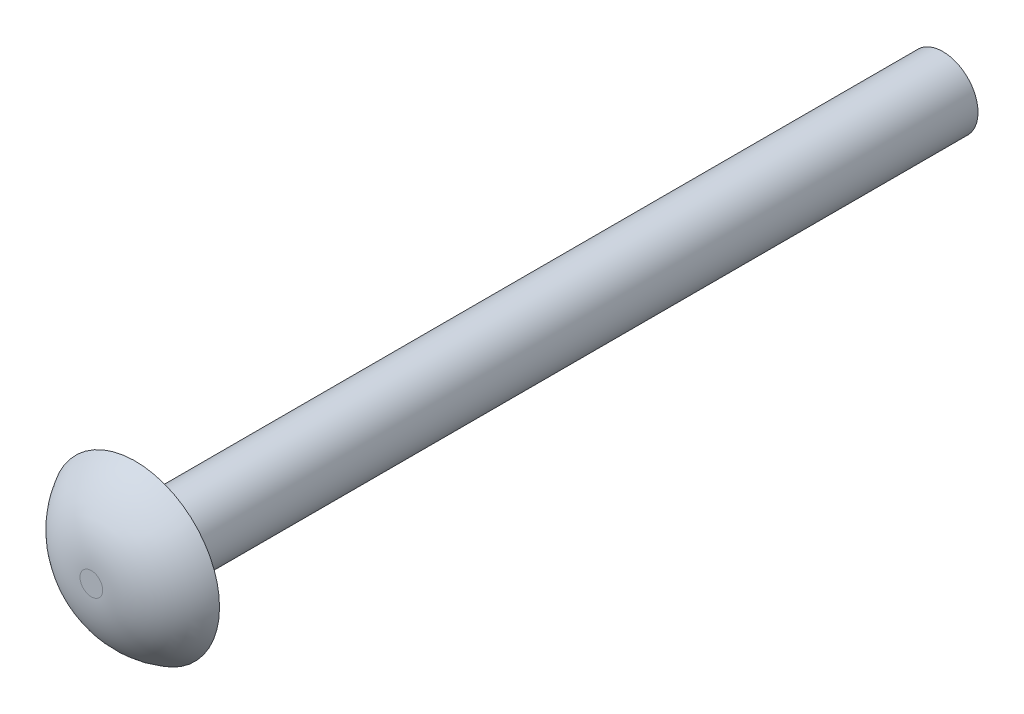
ISO-10303-21;
HEADER;
FILE_DESCRIPTION(('STEP AP214'),'2;1');
FILE_NAME('part.step','',(''),(''),'','','');
FILE_SCHEMA(('AUTOMOTIVE_DESIGN { 1 0 10303 214 1 1 1 1 }'));
ENDSEC;
DATA;
#1=APPLICATION_CONTEXT('core data for automotive mechanical design processes');
#2=APPLICATION_PROTOCOL_DEFINITION('international standard','automotive_design',2000,#1);
#3=PRODUCT_CONTEXT('',#1,'mechanical');
#4=PRODUCT('Part','Part','',(#3));
#5=PRODUCT_RELATED_PRODUCT_CATEGORY('part','',(#4));
#6=PRODUCT_DEFINITION_FORMATION('','',#4);
#7=PRODUCT_DEFINITION_CONTEXT('part definition',#1,'design');
#8=PRODUCT_DEFINITION('design','',#6,#7);
#9=PRODUCT_DEFINITION_SHAPE('','',#8);
#10=(LENGTH_UNIT() NAMED_UNIT(*) SI_UNIT(.MILLI.,.METRE.));
#11=(NAMED_UNIT(*) PLANE_ANGLE_UNIT() SI_UNIT($,.RADIAN.));
#12=(NAMED_UNIT(*) SI_UNIT($,.STERADIAN.) SOLID_ANGLE_UNIT());
#13=UNCERTAINTY_MEASURE_WITH_UNIT(LENGTH_MEASURE(1.E-05),#10,'distance_accuracy_value','');
#14=(GEOMETRIC_REPRESENTATION_CONTEXT(3) GLOBAL_UNCERTAINTY_ASSIGNED_CONTEXT((#13)) GLOBAL_UNIT_ASSIGNED_CONTEXT((#10,
#11,#12)) REPRESENTATION_CONTEXT('',''));
#15=CARTESIAN_POINT('',(0.,0.,0.));
#16=DIRECTION('',(0.,0.,1.));
#17=DIRECTION('',(1.,0.,0.));
#18=AXIS2_PLACEMENT_3D('',#15,#16,#17);
#19=CARTESIAN_POINT('',(-12.5,50.5,20.8));
#20=DIRECTION('',(0.,0.,-1.));
#21=DIRECTION('',(-0.998744511735788,-0.0500939145769443,0.));
#22=AXIS2_PLACEMENT_3D('',#19,#20,#21);
#23=DEGENERATE_TOROIDAL_SURFACE('',#22,0.646688068540962,4.7,.T.);
#24=CARTESIAN_POINT('',(-12.5,50.5,25.5));
#25=DIRECTION('',(0.,0.,1.));
#26=DIRECTION('',(0.998744511735788,0.0500939145769443,0.));
#27=AXIS2_PLACEMENT_3D('',#24,#25,#26);
#28=CIRCLE('',#27,0.646688068540963);
#29=CARTESIAN_POINT('',(-13.1458761592603,50.4676048631366,25.5));
#30=VERTEX_POINT('',#29);
#31=EDGE_CURVE('E35',#30,#30,#28,.T.);
#32=ORIENTED_EDGE('',*,*,#31,.F.);
#33=EDGE_LOOP('',(#32));
#34=FACE_BOUND('',#33,.T.);
#35=CARTESIAN_POINT('',(-12.5,50.5,23.));
#36=DIRECTION('',(0.,0.,1.));
#37=DIRECTION('',(0.998744511735788,0.0500939145769443,0.));
#38=AXIS2_PLACEMENT_3D('',#35,#36,#37);
#39=CIRCLE('',#38,4.8);
#40=CARTESIAN_POINT('',(-17.2939736563318,50.2595492100307,23.));
#41=VERTEX_POINT('',#40);
#42=EDGE_CURVE('E11',#41,#41,#39,.T.);
#43=ORIENTED_EDGE('',*,*,#42,.T.);
#44=EDGE_LOOP('',(#43));
#45=FACE_BOUND('',#44,.T.);
#46=ADVANCED_FACE('F16',(#34,#45),#23,.T.);
#47=CARTESIAN_POINT('',(-12.5,50.5,23.));
#48=DIRECTION('',(0.,0.,-1.));
#49=DIRECTION('',(-0.998744511735788,-0.0500939145769443,0.));
#50=AXIS2_PLACEMENT_3D('',#47,#48,#49);
#51=CYLINDRICAL_SURFACE('',#50,2.);
#52=CARTESIAN_POINT('',(-12.5,50.5,23.));
#53=DIRECTION('',(0.,0.,1.));
#54=DIRECTION('',(0.998744511735788,0.0500939145769443,0.));
#55=AXIS2_PLACEMENT_3D('',#52,#53,#54);
#56=CIRCLE('',#55,2.);
#57=CARTESIAN_POINT('',(-14.4974890234716,50.3998121708461,23.));
#58=VERTEX_POINT('',#57);
#59=EDGE_CURVE('E56',#58,#58,#56,.T.);
#60=ORIENTED_EDGE('',*,*,#59,.F.);
#61=EDGE_LOOP('',(#60));
#62=FACE_BOUND('',#61,.T.);
#63=CARTESIAN_POINT('',(-12.5,50.5,-23.));
#64=DIRECTION('',(0.,0.,1.));
#65=DIRECTION('',(0.998744511735788,0.0500939145769443,0.));
#66=AXIS2_PLACEMENT_3D('',#63,#64,#65);
#67=CIRCLE('',#66,2.);
#68=CARTESIAN_POINT('',(-14.4974890234716,50.3998121708461,-23.));
#69=VERTEX_POINT('',#68);
#70=EDGE_CURVE('E24',#69,#69,#67,.T.);
#71=ORIENTED_EDGE('',*,*,#70,.T.);
#72=EDGE_LOOP('',(#71));
#73=FACE_BOUND('',#72,.T.);
#74=ADVANCED_FACE('F76',(#62,#73),#51,.T.);
#75=CARTESIAN_POINT('',(-12.5,50.5,-23.));
#76=DIRECTION('',(0.,0.,1.));
#77=DIRECTION('',(-0.0500939145769443,0.998744511735788,0.));
#78=AXIS2_PLACEMENT_3D('',#75,#76,#77);
#79=PLANE('',#78);
#80=ORIENTED_EDGE('',*,*,#70,.F.);
#81=EDGE_LOOP('',(#80));
#82=FACE_BOUND('',#81,.T.);
#83=ADVANCED_FACE('F53',(#82),#79,.F.);
#84=CARTESIAN_POINT('',(-12.5,50.5,23.));
#85=DIRECTION('',(0.,0.,1.));
#86=DIRECTION('',(-0.0500939145769443,0.998744511735788,0.));
#87=AXIS2_PLACEMENT_3D('',#84,#85,#86);
#88=PLANE('',#87);
#89=ORIENTED_EDGE('',*,*,#42,.F.);
#90=EDGE_LOOP('',(#89));
#91=FACE_BOUND('',#90,.T.);
#92=ORIENTED_EDGE('',*,*,#59,.T.);
#93=EDGE_LOOP('',(#92));
#94=FACE_BOUND('',#93,.T.);
#95=ADVANCED_FACE('F69',(#91,#94),#88,.F.);
#96=CARTESIAN_POINT('',(-12.5,50.5,25.5));
#97=DIRECTION('',(0.,0.,1.));
#98=DIRECTION('',(-0.0500939145769443,0.998744511735788,0.));
#99=AXIS2_PLACEMENT_3D('',#96,#97,#98);
#100=PLANE('',#99);
#101=ORIENTED_EDGE('',*,*,#31,.T.);
#102=EDGE_LOOP('',(#101));
#103=FACE_BOUND('',#102,.T.);
#104=ADVANCED_FACE('F67',(#103),#100,.T.);
#105=CLOSED_SHELL('',(#46,#74,#83,#95,#104));
#106=MANIFOLD_SOLID_BREP('B1',#105);
#107=ADVANCED_BREP_SHAPE_REPRESENTATION('',(#18,#106),#14);
#108=SHAPE_DEFINITION_REPRESENTATION(#9,#107);
ENDSEC;
END-ISO-10303-21;
